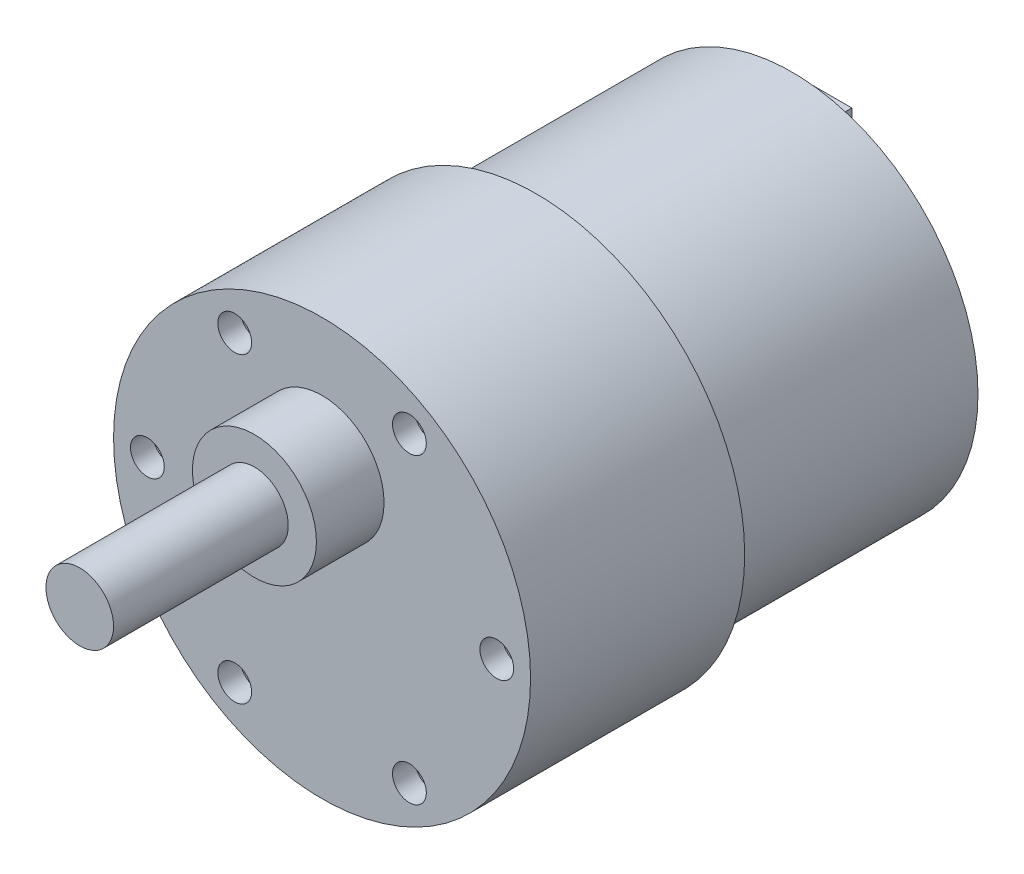
ISO-10303-21;
HEADER;
FILE_DESCRIPTION(('STEP AP214'),'2;1');
FILE_NAME('part.step','',(''),(''),'','','');
FILE_SCHEMA(('AUTOMOTIVE_DESIGN { 1 0 10303 214 1 1 1 1 }'));
ENDSEC;
DATA;
#1=APPLICATION_CONTEXT('core data for automotive mechanical design processes');
#2=APPLICATION_PROTOCOL_DEFINITION('international standard','automotive_design',2000,#1);
#3=PRODUCT_CONTEXT('',#1,'mechanical');
#4=PRODUCT('Part','Part','',(#3));
#5=PRODUCT_RELATED_PRODUCT_CATEGORY('part','',(#4));
#6=PRODUCT_DEFINITION_FORMATION('','',#4);
#7=PRODUCT_DEFINITION_CONTEXT('part definition',#1,'design');
#8=PRODUCT_DEFINITION('design','',#6,#7);
#9=PRODUCT_DEFINITION_SHAPE('','',#8);
#10=(LENGTH_UNIT() NAMED_UNIT(*) SI_UNIT(.MILLI.,.METRE.));
#11=(NAMED_UNIT(*) PLANE_ANGLE_UNIT() SI_UNIT($,.RADIAN.));
#12=(NAMED_UNIT(*) SI_UNIT($,.STERADIAN.) SOLID_ANGLE_UNIT());
#13=UNCERTAINTY_MEASURE_WITH_UNIT(LENGTH_MEASURE(1.E-05),#10,'distance_accuracy_value','');
#14=(GEOMETRIC_REPRESENTATION_CONTEXT(3) GLOBAL_UNCERTAINTY_ASSIGNED_CONTEXT((#13)) GLOBAL_UNIT_ASSIGNED_CONTEXT((#10,
#11,#12)) REPRESENTATION_CONTEXT('',''));
#15=CARTESIAN_POINT('',(0.,0.,0.));
#16=DIRECTION('',(0.,0.,1.));
#17=DIRECTION('',(1.,0.,0.));
#18=AXIS2_PLACEMENT_3D('',#15,#16,#17);
#19=CARTESIAN_POINT('',(0.,0.,22.7));
#20=DIRECTION('',(0.,0.,-1.));
#21=DIRECTION('',(-1.,0.,0.));
#22=AXIS2_PLACEMENT_3D('',#19,#20,#21);
#23=CYLINDRICAL_SURFACE('',#22,16.5);
#24=CARTESIAN_POINT('',(0.,0.,22.7));
#25=DIRECTION('',(0.,0.,1.));
#26=DIRECTION('',(1.,0.,0.));
#27=AXIS2_PLACEMENT_3D('',#24,#25,#26);
#28=CIRCLE('',#27,16.5);
#29=CARTESIAN_POINT('',(16.5,0.,22.7));
#30=VERTEX_POINT('',#29);
#31=EDGE_CURVE('E207',#30,#30,#28,.T.);
#32=ORIENTED_EDGE('',*,*,#31,.F.);
#33=EDGE_LOOP('',(#32));
#34=FACE_BOUND('',#33,.T.);
#35=CARTESIAN_POINT('',(0.,0.,0.));
#36=DIRECTION('',(0.,0.,1.));
#37=DIRECTION('',(1.,0.,0.));
#38=AXIS2_PLACEMENT_3D('',#35,#36,#37);
#39=CIRCLE('',#38,16.5);
#40=CARTESIAN_POINT('',(16.5,0.,0.));
#41=VERTEX_POINT('',#40);
#42=EDGE_CURVE('E44',#41,#41,#39,.T.);
#43=ORIENTED_EDGE('',*,*,#42,.T.);
#44=EDGE_LOOP('',(#43));
#45=FACE_BOUND('',#44,.T.);
#46=ADVANCED_FACE('F41',(#34,#45),#23,.T.);
#47=CARTESIAN_POINT('',(0.,0.,0.));
#48=DIRECTION('',(0.,0.,1.));
#49=DIRECTION('',(1.,0.,0.));
#50=AXIS2_PLACEMENT_3D('',#47,#48,#49);
#51=PLANE('',#50);
#52=DIRECTION('',(-1.,0.,0.));
#53=VECTOR('',#52,1.);
#54=CARTESIAN_POINT('',(1.80964719660372,-12.890256185039,0.));
#55=LINE('',#54,#53);
#56=CARTESIAN_POINT('',(1.80964719660372,-12.890256185039,0.));
#57=VERTEX_POINT('',#56);
#58=CARTESIAN_POINT('',(-1.80964719660372,-12.890256185039,0.));
#59=VERTEX_POINT('',#58);
#60=EDGE_CURVE('E114',#57,#59,#55,.T.);
#61=ORIENTED_EDGE('',*,*,#60,.F.);
#62=DIRECTION('',(0.,1.,0.));
#63=VECTOR('',#62,1.);
#64=CARTESIAN_POINT('',(1.80964719660372,-12.890256185039,0.));
#65=LINE('',#64,#63);
#66=CARTESIAN_POINT('',(1.80964719660372,-11.1084497145369,0.));
#67=VERTEX_POINT('',#66);
#68=EDGE_CURVE('E123',#57,#67,#65,.T.);
#69=ORIENTED_EDGE('',*,*,#68,.T.);
#70=DIRECTION('',(-1.,0.,0.));
#71=VECTOR('',#70,1.);
#72=CARTESIAN_POINT('',(1.80964719660372,-11.1084497145369,0.));
#73=LINE('',#72,#71);
#74=CARTESIAN_POINT('',(-1.80964719660372,-11.1084497145369,0.));
#75=VERTEX_POINT('',#74);
#76=EDGE_CURVE('E131',#67,#75,#73,.T.);
#77=ORIENTED_EDGE('',*,*,#76,.T.);
#78=DIRECTION('',(0.,1.,0.));
#79=VECTOR('',#78,1.);
#80=CARTESIAN_POINT('',(-1.80964719660372,-12.890256185039,0.));
#81=LINE('',#80,#79);
#82=EDGE_CURVE('E58',#59,#75,#81,.T.);
#83=ORIENTED_EDGE('',*,*,#82,.F.);
#84=EDGE_LOOP('',(#61,#69,#77,#83));
#85=FACE_BOUND('',#84,.T.);
#86=DIRECTION('',(-1.,0.,0.));
#87=VECTOR('',#86,1.);
#88=CARTESIAN_POINT('',(0.,12.890256185039,0.));
#89=LINE('',#88,#87);
#90=CARTESIAN_POINT('',(1.80964719660372,12.890256185039,0.));
#91=VERTEX_POINT('',#90);
#92=CARTESIAN_POINT('',(-1.80964719660372,12.890256185039,0.));
#93=VERTEX_POINT('',#92);
#94=EDGE_CURVE('E66',#91,#93,#89,.T.);
#95=ORIENTED_EDGE('',*,*,#94,.T.);
#96=DIRECTION('',(0.,-1.,0.));
#97=VECTOR('',#96,1.);
#98=CARTESIAN_POINT('',(-1.80964719660372,0.,0.));
#99=LINE('',#98,#97);
#100=CARTESIAN_POINT('',(-1.80964719660372,11.1084497145369,0.));
#101=VERTEX_POINT('',#100);
#102=EDGE_CURVE('E130',#93,#101,#99,.T.);
#103=ORIENTED_EDGE('',*,*,#102,.T.);
#104=DIRECTION('',(-1.,0.,0.));
#105=VECTOR('',#104,1.);
#106=CARTESIAN_POINT('',(0.,11.1084497145369,0.));
#107=LINE('',#106,#105);
#108=CARTESIAN_POINT('',(1.80964719660372,11.1084497145369,0.));
#109=VERTEX_POINT('',#108);
#110=EDGE_CURVE('E159',#109,#101,#107,.T.);
#111=ORIENTED_EDGE('',*,*,#110,.F.);
#112=DIRECTION('',(0.,-1.,0.));
#113=VECTOR('',#112,1.);
#114=CARTESIAN_POINT('',(1.80964719660372,0.,0.));
#115=LINE('',#114,#113);
#116=EDGE_CURVE('E174',#91,#109,#115,.T.);
#117=ORIENTED_EDGE('',*,*,#116,.F.);
#118=EDGE_LOOP('',(#95,#103,#111,#117));
#119=FACE_BOUND('',#118,.T.);
#120=CARTESIAN_POINT('',(0.,0.,0.));
#121=DIRECTION('',(0.,0.,-1.));
#122=DIRECTION('',(-1.,0.,0.));
#123=AXIS2_PLACEMENT_3D('',#120,#121,#122);
#124=CIRCLE('',#123,5.);
#125=CARTESIAN_POINT('',(-5.,0.,0.));
#126=VERTEX_POINT('',#125);
#127=EDGE_CURVE('E11',#126,#126,#124,.T.);
#128=ORIENTED_EDGE('',*,*,#127,.F.);
#129=EDGE_LOOP('',(#128));
#130=FACE_BOUND('',#129,.T.);
#131=ORIENTED_EDGE('',*,*,#42,.F.);
#132=EDGE_LOOP('',(#131));
#133=FACE_BOUND('',#132,.T.);
#134=ADVANCED_FACE('F133',(#85,#119,#130,#133),#51,.F.);
#135=CARTESIAN_POINT('',(0.,0.,41.7));
#136=DIRECTION('',(0.,0.,-1.));
#137=DIRECTION('',(-1.,0.,0.));
#138=AXIS2_PLACEMENT_3D('',#135,#136,#137);
#139=CYLINDRICAL_SURFACE('',#138,18.5);
#140=CARTESIAN_POINT('',(0.,0.,41.7));
#141=DIRECTION('',(0.,0.,1.));
#142=DIRECTION('',(1.,0.,0.));
#143=AXIS2_PLACEMENT_3D('',#140,#141,#142);
#144=CIRCLE('',#143,18.5);
#145=CARTESIAN_POINT('',(18.5,0.,41.7));
#146=VERTEX_POINT('',#145);
#147=EDGE_CURVE('E264',#146,#146,#144,.T.);
#148=ORIENTED_EDGE('',*,*,#147,.F.);
#149=EDGE_LOOP('',(#148));
#150=FACE_BOUND('',#149,.T.);
#151=CARTESIAN_POINT('',(0.,0.,22.7));
#152=DIRECTION('',(0.,0.,1.));
#153=DIRECTION('',(1.,0.,0.));
#154=AXIS2_PLACEMENT_3D('',#151,#152,#153);
#155=CIRCLE('',#154,18.5);
#156=CARTESIAN_POINT('',(18.5,0.,22.7));
#157=VERTEX_POINT('',#156);
#158=EDGE_CURVE('E260',#157,#157,#155,.T.);
#159=ORIENTED_EDGE('',*,*,#158,.T.);
#160=EDGE_LOOP('',(#159));
#161=FACE_BOUND('',#160,.T.);
#162=ADVANCED_FACE('F280',(#150,#161),#139,.T.);
#163=CARTESIAN_POINT('',(0.,0.,41.7));
#164=DIRECTION('',(0.,0.,1.));
#165=DIRECTION('',(1.,0.,0.));
#166=AXIS2_PLACEMENT_3D('',#163,#164,#165);
#167=PLANE('',#166);
#168=CARTESIAN_POINT('',(0.,7.,41.7));
#169=DIRECTION('',(0.,0.,1.));
#170=DIRECTION('',(1.,0.,0.));
#171=AXIS2_PLACEMENT_3D('',#168,#169,#170);
#172=CIRCLE('',#171,5.5);
#173=CARTESIAN_POINT('',(5.5,7.,41.7));
#174=VERTEX_POINT('',#173);
#175=EDGE_CURVE('E203',#174,#174,#172,.T.);
#176=ORIENTED_EDGE('',*,*,#175,.F.);
#177=EDGE_LOOP('',(#176));
#178=FACE_BOUND('',#177,.T.);
#179=CARTESIAN_POINT('',(15.5,0.,41.7));
#180=DIRECTION('',(0.,0.,1.));
#181=DIRECTION('',(1.,0.,0.));
#182=AXIS2_PLACEMENT_3D('',#179,#180,#181);
#183=CIRCLE('',#182,1.5);
#184=CARTESIAN_POINT('',(17.,0.,41.7));
#185=VERTEX_POINT('',#184);
#186=EDGE_CURVE('E249',#185,#185,#183,.T.);
#187=ORIENTED_EDGE('',*,*,#186,.F.);
#188=EDGE_LOOP('',(#187));
#189=FACE_BOUND('',#188,.T.);
#190=CARTESIAN_POINT('',(7.74999999999997,-13.4233937586588,41.7));
#191=DIRECTION('',(0.,0.,1.));
#192=DIRECTION('',(1.,0.,0.));
#193=AXIS2_PLACEMENT_3D('',#190,#191,#192);
#194=CIRCLE('',#193,1.5);
#195=CARTESIAN_POINT('',(9.24999999999997,-13.4233937586588,41.7));
#196=VERTEX_POINT('',#195);
#197=EDGE_CURVE('E241',#196,#196,#194,.T.);
#198=ORIENTED_EDGE('',*,*,#197,.F.);
#199=EDGE_LOOP('',(#198));
#200=FACE_BOUND('',#199,.T.);
#201=CARTESIAN_POINT('',(-7.75000000000006,-13.4233937586588,41.7));
#202=DIRECTION('',(0.,0.,1.));
#203=DIRECTION('',(1.,0.,0.));
#204=AXIS2_PLACEMENT_3D('',#201,#202,#203);
#205=CIRCLE('',#204,1.5);
#206=CARTESIAN_POINT('',(-6.25000000000006,-13.4233937586588,41.7));
#207=VERTEX_POINT('',#206);
#208=EDGE_CURVE('E233',#207,#207,#205,.T.);
#209=ORIENTED_EDGE('',*,*,#208,.F.);
#210=EDGE_LOOP('',(#209));
#211=FACE_BOUND('',#210,.T.);
#212=CARTESIAN_POINT('',(-15.5,1.08235921504137E-13,41.7));
#213=DIRECTION('',(0.,0.,1.));
#214=DIRECTION('',(1.,0.,0.));
#215=AXIS2_PLACEMENT_3D('',#212,#213,#214);
#216=CIRCLE('',#215,1.5);
#217=CARTESIAN_POINT('',(-14.,1.08235921504137E-13,41.7));
#218=VERTEX_POINT('',#217);
#219=EDGE_CURVE('E225',#218,#218,#216,.T.);
#220=ORIENTED_EDGE('',*,*,#219,.F.);
#221=EDGE_LOOP('',(#220));
#222=FACE_BOUND('',#221,.T.);
#223=CARTESIAN_POINT('',(7.75000000000016,13.4233937586587,41.7));
#224=DIRECTION('',(0.,0.,1.));
#225=DIRECTION('',(1.,0.,0.));
#226=AXIS2_PLACEMENT_3D('',#223,#224,#225);
#227=CIRCLE('',#226,1.5);
#228=CARTESIAN_POINT('',(9.25000000000016,13.4233937586587,41.7));
#229=VERTEX_POINT('',#228);
#230=EDGE_CURVE('E216',#229,#229,#227,.T.);
#231=ORIENTED_EDGE('',*,*,#230,.F.);
#232=EDGE_LOOP('',(#231));
#233=FACE_BOUND('',#232,.T.);
#234=CARTESIAN_POINT('',(-7.74999999999987,13.4233937586589,41.7));
#235=DIRECTION('',(0.,0.,1.));
#236=DIRECTION('',(1.,0.,0.));
#237=AXIS2_PLACEMENT_3D('',#234,#235,#236);
#238=CIRCLE('',#237,1.5);
#239=CARTESIAN_POINT('',(-6.24999999999987,13.4233937586589,41.7));
#240=VERTEX_POINT('',#239);
#241=EDGE_CURVE('E220',#240,#240,#238,.T.);
#242=ORIENTED_EDGE('',*,*,#241,.F.);
#243=EDGE_LOOP('',(#242));
#244=FACE_BOUND('',#243,.T.);
#245=ORIENTED_EDGE('',*,*,#147,.T.);
#246=EDGE_LOOP('',(#245));
#247=FACE_BOUND('',#246,.T.);
#248=ADVANCED_FACE('F286',(#178,#189,#200,#211,#222,#233,#244,#247),#167,.T.);
#249=CARTESIAN_POINT('',(0.,0.,22.7));
#250=DIRECTION('',(0.,0.,1.));
#251=DIRECTION('',(1.,0.,0.));
#252=AXIS2_PLACEMENT_3D('',#249,#250,#251);
#253=PLANE('',#252);
#254=ORIENTED_EDGE('',*,*,#31,.T.);
#255=EDGE_LOOP('',(#254));
#256=FACE_BOUND('',#255,.T.);
#257=ORIENTED_EDGE('',*,*,#158,.F.);
#258=EDGE_LOOP('',(#257));
#259=FACE_BOUND('',#258,.T.);
#260=ADVANCED_FACE('F292',(#256,#259),#253,.F.);
#261=CARTESIAN_POINT('',(-7.74999999999987,13.4233937586589,39.7));
#262=DIRECTION('',(0.,0.,1.));
#263=DIRECTION('',(1.,0.,0.));
#264=AXIS2_PLACEMENT_3D('',#261,#262,#263);
#265=CYLINDRICAL_SURFACE('',#264,1.5);
#266=CARTESIAN_POINT('',(-7.74999999999987,13.4233937586589,39.7));
#267=DIRECTION('',(0.,0.,1.));
#268=DIRECTION('',(1.,0.,0.));
#269=AXIS2_PLACEMENT_3D('',#266,#267,#268);
#270=CIRCLE('',#269,1.5);
#271=CARTESIAN_POINT('',(-6.24999999999987,13.4233937586589,39.7));
#272=VERTEX_POINT('',#271);
#273=EDGE_CURVE('E256',#272,#272,#270,.T.);
#274=ORIENTED_EDGE('',*,*,#273,.F.);
#275=EDGE_LOOP('',(#274));
#276=FACE_BOUND('',#275,.T.);
#277=ORIENTED_EDGE('',*,*,#241,.T.);
#278=EDGE_LOOP('',(#277));
#279=FACE_BOUND('',#278,.T.);
#280=ADVANCED_FACE('F295',(#276,#279),#265,.F.);
#281=CARTESIAN_POINT('',(-7.74999999999987,13.4233937586589,39.7));
#282=DIRECTION('',(0.,0.,1.));
#283=DIRECTION('',(1.,0.,0.));
#284=AXIS2_PLACEMENT_3D('',#281,#282,#283);
#285=PLANE('',#284);
#286=ORIENTED_EDGE('',*,*,#273,.T.);
#287=EDGE_LOOP('',(#286));
#288=FACE_BOUND('',#287,.T.);
#289=ADVANCED_FACE('F301',(#288),#285,.T.);
#290=CARTESIAN_POINT('',(7.75000000000016,13.4233937586587,39.7));
#291=DIRECTION('',(0.,0.,1.));
#292=DIRECTION('',(1.,0.,0.));
#293=AXIS2_PLACEMENT_3D('',#290,#291,#292);
#294=CYLINDRICAL_SURFACE('',#293,1.5);
#295=CARTESIAN_POINT('',(7.75000000000016,13.4233937586587,39.7));
#296=DIRECTION('',(0.,0.,1.));
#297=DIRECTION('',(1.,0.,0.));
#298=AXIS2_PLACEMENT_3D('',#295,#296,#297);
#299=CIRCLE('',#298,1.5);
#300=CARTESIAN_POINT('',(9.25000000000016,13.4233937586587,39.7));
#301=VERTEX_POINT('',#300);
#302=EDGE_CURVE('E221',#301,#301,#299,.T.);
#303=ORIENTED_EDGE('',*,*,#302,.F.);
#304=EDGE_LOOP('',(#303));
#305=FACE_BOUND('',#304,.T.);
#306=ORIENTED_EDGE('',*,*,#230,.T.);
#307=EDGE_LOOP('',(#306));
#308=FACE_BOUND('',#307,.T.);
#309=ADVANCED_FACE('F305',(#305,#308),#294,.F.);
#310=CARTESIAN_POINT('',(7.75000000000016,13.4233937586587,39.7));
#311=DIRECTION('',(0.,0.,1.));
#312=DIRECTION('',(1.,0.,0.));
#313=AXIS2_PLACEMENT_3D('',#310,#311,#312);
#314=PLANE('',#313);
#315=ORIENTED_EDGE('',*,*,#302,.T.);
#316=EDGE_LOOP('',(#315));
#317=FACE_BOUND('',#316,.T.);
#318=ADVANCED_FACE('F339',(#317),#314,.T.);
#319=CARTESIAN_POINT('',(-15.5,1.08235921504137E-13,39.7));
#320=DIRECTION('',(0.,0.,1.));
#321=DIRECTION('',(1.,0.,0.));
#322=AXIS2_PLACEMENT_3D('',#319,#320,#321);
#323=CYLINDRICAL_SURFACE('',#322,1.5);
#324=CARTESIAN_POINT('',(-15.5,1.08235921504137E-13,39.7));
#325=DIRECTION('',(0.,0.,1.));
#326=DIRECTION('',(1.,0.,0.));
#327=AXIS2_PLACEMENT_3D('',#324,#325,#326);
#328=CIRCLE('',#327,1.5);
#329=CARTESIAN_POINT('',(-14.,1.08235921504137E-13,39.7));
#330=VERTEX_POINT('',#329);
#331=EDGE_CURVE('E229',#330,#330,#328,.T.);
#332=ORIENTED_EDGE('',*,*,#331,.F.);
#333=EDGE_LOOP('',(#332));
#334=FACE_BOUND('',#333,.T.);
#335=ORIENTED_EDGE('',*,*,#219,.T.);
#336=EDGE_LOOP('',(#335));
#337=FACE_BOUND('',#336,.T.);
#338=ADVANCED_FACE('F335',(#334,#337),#323,.F.);
#339=CARTESIAN_POINT('',(-15.5,1.08235921504137E-13,39.7));
#340=DIRECTION('',(0.,0.,1.));
#341=DIRECTION('',(1.,0.,0.));
#342=AXIS2_PLACEMENT_3D('',#339,#340,#341);
#343=PLANE('',#342);
#344=ORIENTED_EDGE('',*,*,#331,.T.);
#345=EDGE_LOOP('',(#344));
#346=FACE_BOUND('',#345,.T.);
#347=ADVANCED_FACE('F331',(#346),#343,.T.);
#348=CARTESIAN_POINT('',(-7.75000000000006,-13.4233937586588,39.7));
#349=DIRECTION('',(0.,0.,1.));
#350=DIRECTION('',(1.,0.,0.));
#351=AXIS2_PLACEMENT_3D('',#348,#349,#350);
#352=CYLINDRICAL_SURFACE('',#351,1.5);
#353=CARTESIAN_POINT('',(-7.75000000000006,-13.4233937586588,39.7));
#354=DIRECTION('',(0.,0.,1.));
#355=DIRECTION('',(1.,0.,0.));
#356=AXIS2_PLACEMENT_3D('',#353,#354,#355);
#357=CIRCLE('',#356,1.5);
#358=CARTESIAN_POINT('',(-6.25000000000006,-13.4233937586588,39.7));
#359=VERTEX_POINT('',#358);
#360=EDGE_CURVE('E237',#359,#359,#357,.T.);
#361=ORIENTED_EDGE('',*,*,#360,.F.);
#362=EDGE_LOOP('',(#361));
#363=FACE_BOUND('',#362,.T.);
#364=ORIENTED_EDGE('',*,*,#208,.T.);
#365=EDGE_LOOP('',(#364));
#366=FACE_BOUND('',#365,.T.);
#367=ADVANCED_FACE('F327',(#363,#366),#352,.F.);
#368=CARTESIAN_POINT('',(-7.75000000000006,-13.4233937586588,39.7));
#369=DIRECTION('',(0.,0.,1.));
#370=DIRECTION('',(1.,0.,0.));
#371=AXIS2_PLACEMENT_3D('',#368,#369,#370);
#372=PLANE('',#371);
#373=ORIENTED_EDGE('',*,*,#360,.T.);
#374=EDGE_LOOP('',(#373));
#375=FACE_BOUND('',#374,.T.);
#376=ADVANCED_FACE('F323',(#375),#372,.T.);
#377=CARTESIAN_POINT('',(7.74999999999997,-13.4233937586588,39.7));
#378=DIRECTION('',(0.,0.,1.));
#379=DIRECTION('',(1.,0.,0.));
#380=AXIS2_PLACEMENT_3D('',#377,#378,#379);
#381=CYLINDRICAL_SURFACE('',#380,1.5);
#382=CARTESIAN_POINT('',(7.74999999999997,-13.4233937586588,39.7));
#383=DIRECTION('',(0.,0.,1.));
#384=DIRECTION('',(1.,0.,0.));
#385=AXIS2_PLACEMENT_3D('',#382,#383,#384);
#386=CIRCLE('',#385,1.5);
#387=CARTESIAN_POINT('',(9.24999999999997,-13.4233937586588,39.7));
#388=VERTEX_POINT('',#387);
#389=EDGE_CURVE('E245',#388,#388,#386,.T.);
#390=ORIENTED_EDGE('',*,*,#389,.F.);
#391=EDGE_LOOP('',(#390));
#392=FACE_BOUND('',#391,.T.);
#393=ORIENTED_EDGE('',*,*,#197,.T.);
#394=EDGE_LOOP('',(#393));
#395=FACE_BOUND('',#394,.T.);
#396=ADVANCED_FACE('F319',(#392,#395),#381,.F.);
#397=CARTESIAN_POINT('',(7.74999999999997,-13.4233937586588,39.7));
#398=DIRECTION('',(0.,0.,1.));
#399=DIRECTION('',(1.,0.,0.));
#400=AXIS2_PLACEMENT_3D('',#397,#398,#399);
#401=PLANE('',#400);
#402=ORIENTED_EDGE('',*,*,#389,.T.);
#403=EDGE_LOOP('',(#402));
#404=FACE_BOUND('',#403,.T.);
#405=ADVANCED_FACE('F315',(#404),#401,.T.);
#406=CARTESIAN_POINT('',(15.5,0.,39.7));
#407=DIRECTION('',(0.,0.,1.));
#408=DIRECTION('',(1.,0.,0.));
#409=AXIS2_PLACEMENT_3D('',#406,#407,#408);
#410=CYLINDRICAL_SURFACE('',#409,1.5);
#411=CARTESIAN_POINT('',(15.5,0.,39.7));
#412=DIRECTION('',(0.,0.,1.));
#413=DIRECTION('',(1.,0.,0.));
#414=AXIS2_PLACEMENT_3D('',#411,#412,#413);
#415=CIRCLE('',#414,1.5);
#416=CARTESIAN_POINT('',(17.,0.,39.7));
#417=VERTEX_POINT('',#416);
#418=EDGE_CURVE('E212',#417,#417,#415,.T.);
#419=ORIENTED_EDGE('',*,*,#418,.F.);
#420=EDGE_LOOP('',(#419));
#421=FACE_BOUND('',#420,.T.);
#422=ORIENTED_EDGE('',*,*,#186,.T.);
#423=EDGE_LOOP('',(#422));
#424=FACE_BOUND('',#423,.T.);
#425=ADVANCED_FACE('F311',(#421,#424),#410,.F.);
#426=CARTESIAN_POINT('',(15.5,0.,39.7));
#427=DIRECTION('',(0.,0.,1.));
#428=DIRECTION('',(1.,0.,0.));
#429=AXIS2_PLACEMENT_3D('',#426,#427,#428);
#430=PLANE('',#429);
#431=ORIENTED_EDGE('',*,*,#418,.T.);
#432=EDGE_LOOP('',(#431));
#433=FACE_BOUND('',#432,.T.);
#434=ADVANCED_FACE('F307',(#433),#430,.T.);
#435=CARTESIAN_POINT('',(0.,7.,47.7));
#436=DIRECTION('',(0.,0.,-1.));
#437=DIRECTION('',(-1.,0.,0.));
#438=AXIS2_PLACEMENT_3D('',#435,#436,#437);
#439=CYLINDRICAL_SURFACE('',#438,5.5);
#440=CARTESIAN_POINT('',(0.,7.,47.7));
#441=DIRECTION('',(0.,0.,1.));
#442=DIRECTION('',(1.,0.,0.));
#443=AXIS2_PLACEMENT_3D('',#440,#441,#442);
#444=CIRCLE('',#443,5.5);
#445=CARTESIAN_POINT('',(5.5,7.,47.7));
#446=VERTEX_POINT('',#445);
#447=EDGE_CURVE('E208',#446,#446,#444,.T.);
#448=ORIENTED_EDGE('',*,*,#447,.F.);
#449=EDGE_LOOP('',(#448));
#450=FACE_BOUND('',#449,.T.);
#451=ORIENTED_EDGE('',*,*,#175,.T.);
#452=EDGE_LOOP('',(#451));
#453=FACE_BOUND('',#452,.T.);
#454=ADVANCED_FACE('F310',(#450,#453),#439,.T.);
#455=CARTESIAN_POINT('',(0.,7.,47.7));
#456=DIRECTION('',(0.,0.,1.));
#457=DIRECTION('',(1.,0.,0.));
#458=AXIS2_PLACEMENT_3D('',#455,#456,#457);
#459=PLANE('',#458);
#460=CARTESIAN_POINT('',(0.,7.,47.7));
#461=DIRECTION('',(0.,0.,1.));
#462=DIRECTION('',(1.,0.,0.));
#463=AXIS2_PLACEMENT_3D('',#460,#461,#462);
#464=CIRCLE('',#463,3.);
#465=CARTESIAN_POINT('',(3.,7.,47.7));
#466=VERTEX_POINT('',#465);
#467=EDGE_CURVE('E50',#466,#466,#464,.T.);
#468=ORIENTED_EDGE('',*,*,#467,.F.);
#469=EDGE_LOOP('',(#468));
#470=FACE_BOUND('',#469,.T.);
#471=ORIENTED_EDGE('',*,*,#447,.T.);
#472=EDGE_LOOP('',(#471));
#473=FACE_BOUND('',#472,.T.);
#474=ADVANCED_FACE('F349',(#470,#473),#459,.T.);
#475=CARTESIAN_POINT('',(0.,7.,63.2));
#476=DIRECTION('',(0.,0.,-1.));
#477=DIRECTION('',(-1.,0.,0.));
#478=AXIS2_PLACEMENT_3D('',#475,#476,#477);
#479=CYLINDRICAL_SURFACE('',#478,3.);
#480=CARTESIAN_POINT('',(0.,7.,63.2));
#481=DIRECTION('',(0.,0.,1.));
#482=DIRECTION('',(1.,0.,0.));
#483=AXIS2_PLACEMENT_3D('',#480,#481,#482);
#484=CIRCLE('',#483,3.);
#485=CARTESIAN_POINT('',(3.,7.,63.2));
#486=VERTEX_POINT('',#485);
#487=EDGE_CURVE('E198',#486,#486,#484,.T.);
#488=ORIENTED_EDGE('',*,*,#487,.F.);
#489=EDGE_LOOP('',(#488));
#490=FACE_BOUND('',#489,.T.);
#491=ORIENTED_EDGE('',*,*,#467,.T.);
#492=EDGE_LOOP('',(#491));
#493=FACE_BOUND('',#492,.T.);
#494=ADVANCED_FACE('F353',(#490,#493),#479,.T.);
#495=CARTESIAN_POINT('',(0.,7.,63.2));
#496=DIRECTION('',(0.,0.,1.));
#497=DIRECTION('',(1.,0.,0.));
#498=AXIS2_PLACEMENT_3D('',#495,#496,#497);
#499=PLANE('',#498);
#500=ORIENTED_EDGE('',*,*,#487,.T.);
#501=EDGE_LOOP('',(#500));
#502=FACE_BOUND('',#501,.T.);
#503=ADVANCED_FACE('F357',(#502),#499,.T.);
#504=CARTESIAN_POINT('',(0.,0.,-2.8));
#505=DIRECTION('',(0.,0.,1.));
#506=DIRECTION('',(1.,0.,0.));
#507=AXIS2_PLACEMENT_3D('',#504,#505,#506);
#508=CYLINDRICAL_SURFACE('',#507,5.);
#509=CARTESIAN_POINT('',(0.,0.,-2.8));
#510=DIRECTION('',(0.,0.,-1.));
#511=DIRECTION('',(-1.,0.,0.));
#512=AXIS2_PLACEMENT_3D('',#509,#510,#511);
#513=CIRCLE('',#512,5.);
#514=CARTESIAN_POINT('',(-5.,0.,-2.8));
#515=VERTEX_POINT('',#514);
#516=EDGE_CURVE('E195',#515,#515,#513,.T.);
#517=ORIENTED_EDGE('',*,*,#516,.F.);
#518=EDGE_LOOP('',(#517));
#519=FACE_BOUND('',#518,.T.);
#520=ORIENTED_EDGE('',*,*,#127,.T.);
#521=EDGE_LOOP('',(#520));
#522=FACE_BOUND('',#521,.T.);
#523=ADVANCED_FACE('F361',(#519,#522),#508,.T.);
#524=CARTESIAN_POINT('',(0.,0.,-2.8));
#525=DIRECTION('',(0.,0.,-1.));
#526=DIRECTION('',(-1.,0.,0.));
#527=AXIS2_PLACEMENT_3D('',#524,#525,#526);
#528=PLANE('',#527);
#529=ORIENTED_EDGE('',*,*,#516,.T.);
#530=EDGE_LOOP('',(#529));
#531=FACE_BOUND('',#530,.T.);
#532=ADVANCED_FACE('F365',(#531),#528,.T.);
#533=CARTESIAN_POINT('',(-1.80964719660372,0.,-3.5));
#534=DIRECTION('',(-1.,0.,0.));
#535=DIRECTION('',(0.,0.,1.));
#536=AXIS2_PLACEMENT_3D('',#533,#534,#535);
#537=PLANE('',#536);
#538=ORIENTED_EDGE('',*,*,#102,.F.);
#539=DIRECTION('',(0.,0.,1.));
#540=VECTOR('',#539,1.);
#541=CARTESIAN_POINT('',(-1.80964719660372,12.890256185039,-3.5));
#542=LINE('',#541,#540);
#543=CARTESIAN_POINT('',(-1.80964719660372,12.890256185039,-3.5));
#544=VERTEX_POINT('',#543);
#545=EDGE_CURVE('E192',#544,#93,#542,.T.);
#546=ORIENTED_EDGE('',*,*,#545,.F.);
#547=DIRECTION('',(0.,-1.,0.));
#548=VECTOR('',#547,1.);
#549=CARTESIAN_POINT('',(-1.80964719660372,0.,-3.5));
#550=LINE('',#549,#548);
#551=CARTESIAN_POINT('',(-1.80964719660372,11.1084497145369,-3.5));
#552=VERTEX_POINT('',#551);
#553=EDGE_CURVE('E154',#544,#552,#550,.T.);
#554=ORIENTED_EDGE('',*,*,#553,.T.);
#555=DIRECTION('',(0.,0.,1.));
#556=VECTOR('',#555,1.);
#557=CARTESIAN_POINT('',(-1.80964719660372,11.1084497145369,-3.5));
#558=LINE('',#557,#556);
#559=EDGE_CURVE('E169',#552,#101,#558,.T.);
#560=ORIENTED_EDGE('',*,*,#559,.T.);
#561=EDGE_LOOP('',(#538,#546,#554,#560));
#562=FACE_BOUND('',#561,.T.);
#563=ADVANCED_FACE('F369',(#562),#537,.T.);
#564=CARTESIAN_POINT('',(0.,12.890256185039,-3.5));
#565=DIRECTION('',(0.,1.,0.));
#566=DIRECTION('',(0.,0.,1.));
#567=AXIS2_PLACEMENT_3D('',#564,#565,#566);
#568=PLANE('',#567);
#569=ORIENTED_EDGE('',*,*,#94,.F.);
#570=DIRECTION('',(0.,0.,1.));
#571=VECTOR('',#570,1.);
#572=CARTESIAN_POINT('',(1.80964719660372,12.890256185039,-3.5));
#573=LINE('',#572,#571);
#574=CARTESIAN_POINT('',(1.80964719660372,12.890256185039,-3.5));
#575=VERTEX_POINT('',#574);
#576=EDGE_CURVE('E188',#575,#91,#573,.T.);
#577=ORIENTED_EDGE('',*,*,#576,.F.);
#578=DIRECTION('',(-1.,0.,0.));
#579=VECTOR('',#578,1.);
#580=CARTESIAN_POINT('',(0.,12.890256185039,-3.5));
#581=LINE('',#580,#579);
#582=EDGE_CURVE('E158',#575,#544,#581,.T.);
#583=ORIENTED_EDGE('',*,*,#582,.T.);
#584=ORIENTED_EDGE('',*,*,#545,.T.);
#585=EDGE_LOOP('',(#569,#577,#583,#584));
#586=FACE_BOUND('',#585,.T.);
#587=ADVANCED_FACE('F373',(#586),#568,.T.);
#588=CARTESIAN_POINT('',(1.80964719660372,0.,-3.5));
#589=DIRECTION('',(-1.,0.,0.));
#590=DIRECTION('',(0.,0.,1.));
#591=AXIS2_PLACEMENT_3D('',#588,#589,#590);
#592=PLANE('',#591);
#593=ORIENTED_EDGE('',*,*,#116,.T.);
#594=DIRECTION('',(0.,0.,1.));
#595=VECTOR('',#594,1.);
#596=CARTESIAN_POINT('',(1.80964719660372,11.1084497145369,-3.5));
#597=LINE('',#596,#595);
#598=CARTESIAN_POINT('',(1.80964719660372,11.1084497145369,-3.5));
#599=VERTEX_POINT('',#598);
#600=EDGE_CURVE('E184',#599,#109,#597,.T.);
#601=ORIENTED_EDGE('',*,*,#600,.F.);
#602=DIRECTION('',(0.,-1.,0.));
#603=VECTOR('',#602,1.);
#604=CARTESIAN_POINT('',(1.80964719660372,0.,-3.5));
#605=LINE('',#604,#603);
#606=EDGE_CURVE('E163',#575,#599,#605,.T.);
#607=ORIENTED_EDGE('',*,*,#606,.F.);
#608=ORIENTED_EDGE('',*,*,#576,.T.);
#609=EDGE_LOOP('',(#593,#601,#607,#608));
#610=FACE_BOUND('',#609,.T.);
#611=ADVANCED_FACE('F377',(#610),#592,.F.);
#612=CARTESIAN_POINT('',(0.,11.1084497145369,-3.5));
#613=DIRECTION('',(0.,1.,0.));
#614=DIRECTION('',(0.,0.,1.));
#615=AXIS2_PLACEMENT_3D('',#612,#613,#614);
#616=PLANE('',#615);
#617=ORIENTED_EDGE('',*,*,#110,.T.);
#618=ORIENTED_EDGE('',*,*,#559,.F.);
#619=DIRECTION('',(-1.,0.,0.));
#620=VECTOR('',#619,1.);
#621=CARTESIAN_POINT('',(0.,11.1084497145369,-3.5));
#622=LINE('',#621,#620);
#623=EDGE_CURVE('E166',#599,#552,#622,.T.);
#624=ORIENTED_EDGE('',*,*,#623,.F.);
#625=ORIENTED_EDGE('',*,*,#600,.T.);
#626=EDGE_LOOP('',(#617,#618,#624,#625));
#627=FACE_BOUND('',#626,.T.);
#628=ADVANCED_FACE('F381',(#627),#616,.F.);
#629=CARTESIAN_POINT('',(0.,0.,-3.5));
#630=DIRECTION('',(0.,0.,-1.));
#631=DIRECTION('',(-1.,0.,0.));
#632=AXIS2_PLACEMENT_3D('',#629,#630,#631);
#633=PLANE('',#632);
#634=ORIENTED_EDGE('',*,*,#553,.F.);
#635=ORIENTED_EDGE('',*,*,#582,.F.);
#636=ORIENTED_EDGE('',*,*,#606,.T.);
#637=ORIENTED_EDGE('',*,*,#623,.T.);
#638=EDGE_LOOP('',(#634,#635,#636,#637));
#639=FACE_BOUND('',#638,.T.);
#640=ADVANCED_FACE('F385',(#639),#633,.T.);
#641=CARTESIAN_POINT('',(1.80964719660372,-12.890256185039,-3.5));
#642=DIRECTION('',(1.,0.,0.));
#643=DIRECTION('',(0.,0.,-1.));
#644=AXIS2_PLACEMENT_3D('',#641,#642,#643);
#645=PLANE('',#644);
#646=ORIENTED_EDGE('',*,*,#68,.F.);
#647=DIRECTION('',(0.,0.,1.));
#648=VECTOR('',#647,1.);
#649=CARTESIAN_POINT('',(1.80964719660372,-12.890256185039,-3.5));
#650=LINE('',#649,#648);
#651=CARTESIAN_POINT('',(1.80964719660372,-12.890256185039,-3.5));
#652=VERTEX_POINT('',#651);
#653=EDGE_CURVE('E109',#652,#57,#650,.T.);
#654=ORIENTED_EDGE('',*,*,#653,.F.);
#655=DIRECTION('',(0.,1.,0.));
#656=VECTOR('',#655,1.);
#657=CARTESIAN_POINT('',(1.80964719660372,-12.890256185039,-3.5));
#658=LINE('',#657,#656);
#659=CARTESIAN_POINT('',(1.80964719660372,-11.1084497145369,-3.5));
#660=VERTEX_POINT('',#659);
#661=EDGE_CURVE('E135',#652,#660,#658,.T.);
#662=ORIENTED_EDGE('',*,*,#661,.T.);
#663=DIRECTION('',(0.,0.,1.));
#664=VECTOR('',#663,1.);
#665=CARTESIAN_POINT('',(1.80964719660372,-11.1084497145369,-3.5));
#666=LINE('',#665,#664);
#667=EDGE_CURVE('E125',#660,#67,#666,.T.);
#668=ORIENTED_EDGE('',*,*,#667,.T.);
#669=EDGE_LOOP('',(#646,#654,#662,#668));
#670=FACE_BOUND('',#669,.T.);
#671=ADVANCED_FACE('F124',(#670),#645,.T.);
#672=CARTESIAN_POINT('',(1.80964719660372,-12.890256185039,-3.5));
#673=DIRECTION('',(0.,1.,0.));
#674=DIRECTION('',(0.,0.,1.));
#675=AXIS2_PLACEMENT_3D('',#672,#673,#674);
#676=PLANE('',#675);
#677=ORIENTED_EDGE('',*,*,#60,.T.);
#678=DIRECTION('',(0.,0.,1.));
#679=VECTOR('',#678,1.);
#680=CARTESIAN_POINT('',(-1.80964719660372,-12.890256185039,-3.5));
#681=LINE('',#680,#679);
#682=CARTESIAN_POINT('',(-1.80964719660372,-12.890256185039,-3.5));
#683=VERTEX_POINT('',#682);
#684=EDGE_CURVE('E120',#683,#59,#681,.T.);
#685=ORIENTED_EDGE('',*,*,#684,.F.);
#686=DIRECTION('',(-1.,0.,0.));
#687=VECTOR('',#686,1.);
#688=CARTESIAN_POINT('',(1.80964719660372,-12.890256185039,-3.5));
#689=LINE('',#688,#687);
#690=EDGE_CURVE('E115',#652,#683,#689,.T.);
#691=ORIENTED_EDGE('',*,*,#690,.F.);
#692=ORIENTED_EDGE('',*,*,#653,.T.);
#693=EDGE_LOOP('',(#677,#685,#691,#692));
#694=FACE_BOUND('',#693,.T.);
#695=ADVANCED_FACE('F111',(#694),#676,.F.);
#696=CARTESIAN_POINT('',(-1.80964719660372,-12.890256185039,-3.5));
#697=DIRECTION('',(1.,0.,0.));
#698=DIRECTION('',(0.,0.,-1.));
#699=AXIS2_PLACEMENT_3D('',#696,#697,#698);
#700=PLANE('',#699);
#701=ORIENTED_EDGE('',*,*,#82,.T.);
#702=DIRECTION('',(0.,0.,1.));
#703=VECTOR('',#702,1.);
#704=CARTESIAN_POINT('',(-1.80964719660372,-11.1084497145369,-3.5));
#705=LINE('',#704,#703);
#706=CARTESIAN_POINT('',(-1.80964719660372,-11.1084497145369,-3.5));
#707=VERTEX_POINT('',#706);
#708=EDGE_CURVE('E599',#707,#75,#705,.T.);
#709=ORIENTED_EDGE('',*,*,#708,.F.);
#710=DIRECTION('',(0.,1.,0.));
#711=VECTOR('',#710,1.);
#712=CARTESIAN_POINT('',(-1.80964719660372,-12.890256185039,-3.5));
#713=LINE('',#712,#711);
#714=EDGE_CURVE('E148',#683,#707,#713,.T.);
#715=ORIENTED_EDGE('',*,*,#714,.F.);
#716=ORIENTED_EDGE('',*,*,#684,.T.);
#717=EDGE_LOOP('',(#701,#709,#715,#716));
#718=FACE_BOUND('',#717,.T.);
#719=ADVANCED_FACE('F397',(#718),#700,.F.);
#720=CARTESIAN_POINT('',(1.80964719660372,-11.1084497145369,-3.5));
#721=DIRECTION('',(0.,1.,0.));
#722=DIRECTION('',(0.,0.,1.));
#723=AXIS2_PLACEMENT_3D('',#720,#721,#722);
#724=PLANE('',#723);
#725=ORIENTED_EDGE('',*,*,#76,.F.);
#726=ORIENTED_EDGE('',*,*,#667,.F.);
#727=DIRECTION('',(-1.,0.,0.));
#728=VECTOR('',#727,1.);
#729=CARTESIAN_POINT('',(1.80964719660372,-11.1084497145369,-3.5));
#730=LINE('',#729,#728);
#731=EDGE_CURVE('E140',#660,#707,#730,.T.);
#732=ORIENTED_EDGE('',*,*,#731,.T.);
#733=ORIENTED_EDGE('',*,*,#708,.T.);
#734=EDGE_LOOP('',(#725,#726,#732,#733));
#735=FACE_BOUND('',#734,.T.);
#736=ADVANCED_FACE('F393',(#735),#724,.T.);
#737=CARTESIAN_POINT('',(0.,0.,-3.5));
#738=DIRECTION('',(0.,0.,1.));
#739=DIRECTION('',(1.,0.,0.));
#740=AXIS2_PLACEMENT_3D('',#737,#738,#739);
#741=PLANE('',#740);
#742=ORIENTED_EDGE('',*,*,#661,.F.);
#743=ORIENTED_EDGE('',*,*,#690,.T.);
#744=ORIENTED_EDGE('',*,*,#714,.T.);
#745=ORIENTED_EDGE('',*,*,#731,.F.);
#746=EDGE_LOOP('',(#742,#743,#744,#745));
#747=FACE_BOUND('',#746,.T.);
#748=ADVANCED_FACE('F390',(#747),#741,.F.);
#749=CLOSED_SHELL('',(#46,#134,#162,#248,#260,#280,#289,#309,#318,#338,#347,#367,#376,#396,#405,
#425,#434,#454,#474,#494,#503,#523,#532,#563,#587,#611,#628,#640,#671,#695,#719,#736,#748));
#750=MANIFOLD_SOLID_BREP('B2',#749);
#751=ADVANCED_BREP_SHAPE_REPRESENTATION('',(#18,#750),#14);
#752=SHAPE_DEFINITION_REPRESENTATION(#9,#751);
ENDSEC;
END-ISO-10303-21;
